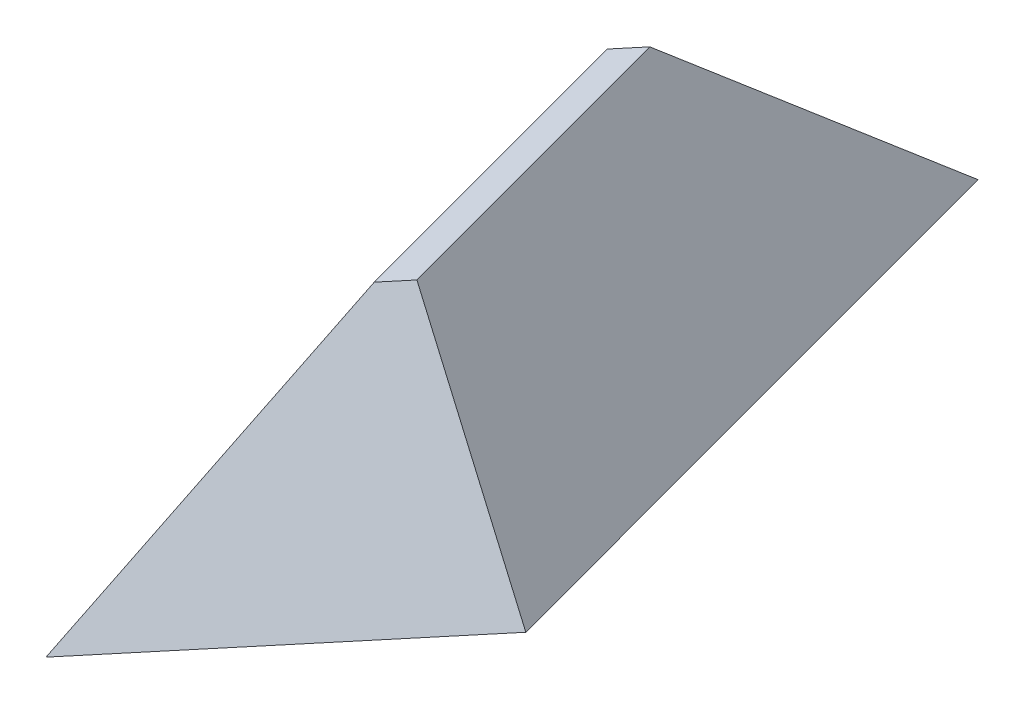
ISO-10303-21;
HEADER;
FILE_DESCRIPTION(('STEP AP214'),'2;1');
FILE_NAME('part.step','',(''),(''),'','','');
FILE_SCHEMA(('AUTOMOTIVE_DESIGN { 1 0 10303 214 1 1 1 1 }'));
ENDSEC;
DATA;
#1=APPLICATION_CONTEXT('core data for automotive mechanical design processes');
#2=APPLICATION_PROTOCOL_DEFINITION('international standard','automotive_design',2000,#1);
#3=PRODUCT_CONTEXT('',#1,'mechanical');
#4=PRODUCT('Part','Part','',(#3));
#5=PRODUCT_RELATED_PRODUCT_CATEGORY('part','',(#4));
#6=PRODUCT_DEFINITION_FORMATION('','',#4);
#7=PRODUCT_DEFINITION_CONTEXT('part definition',#1,'design');
#8=PRODUCT_DEFINITION('design','',#6,#7);
#9=PRODUCT_DEFINITION_SHAPE('','',#8);
#10=(LENGTH_UNIT() NAMED_UNIT(*) SI_UNIT(.MILLI.,.METRE.));
#11=(NAMED_UNIT(*) PLANE_ANGLE_UNIT() SI_UNIT($,.RADIAN.));
#12=(NAMED_UNIT(*) SI_UNIT($,.STERADIAN.) SOLID_ANGLE_UNIT());
#13=UNCERTAINTY_MEASURE_WITH_UNIT(LENGTH_MEASURE(1.E-05),#10,'distance_accuracy_value','');
#14=(GEOMETRIC_REPRESENTATION_CONTEXT(3) GLOBAL_UNCERTAINTY_ASSIGNED_CONTEXT((#13)) GLOBAL_UNIT_ASSIGNED_CONTEXT((#10,
#11,#12)) REPRESENTATION_CONTEXT('',''));
#15=CARTESIAN_POINT('',(0.,0.,0.));
#16=DIRECTION('',(0.,0.,1.));
#17=DIRECTION('',(1.,0.,0.));
#18=AXIS2_PLACEMENT_3D('',#15,#16,#17);
#19=CARTESIAN_POINT('',(-0.109027255683212,0.,9.09803012849915));
#20=DIRECTION('',(0.664717477698489,0.500000000000001,0.555113209032318));
#21=DIRECTION('',(0.640989521331052,0.,-0.767549629368543));
#22=AXIS2_PLACEMENT_3D('',#19,#20,#21);
#23=PLANE('',#22);
#24=DIRECTION('',(0.640989521331052,0.,-0.767549629368543));
#25=VECTOR('',#24,1.);
#26=CARTESIAN_POINT('',(-0.109027255683212,0.,9.09803012849915));
#27=LINE('',#26,#25);
#28=CARTESIAN_POINT('',(-0.109027255683212,0.,9.09803012849915));
#29=VERTEX_POINT('',#28);
#30=CARTESIAN_POINT('',(2.87004363926258,0.,5.53075689674642));
#31=VERTEX_POINT('',#30);
#32=EDGE_CURVE('E79',#29,#31,#27,.T.);
#33=ORIENTED_EDGE('',*,*,#32,.T.);
#34=DIRECTION('',(0.532562407172726,-0.838224629779067,0.117289183210292));
#35=VECTOR('',#34,1.);
#36=CARTESIAN_POINT('',(2.87004363926258,0.,5.53075689674642));
#37=LINE('',#36,#35);
#38=CARTESIAN_POINT('',(0.964006564285093,3.,5.11097974259191));
#39=VERTEX_POINT('',#38);
#40=EDGE_CURVE('E11',#39,#31,#37,.T.);
#41=ORIENTED_EDGE('',*,*,#40,.F.);
#42=DIRECTION('',(-0.640989521331052,0.,0.767549629368543));
#43=VECTOR('',#42,1.);
#44=CARTESIAN_POINT('',(-1.43846221108019,3.,7.98780371043451));
#45=LINE('',#44,#43);
#46=CARTESIAN_POINT('',(0.699238393047662,3.,5.42802503731042));
#47=VERTEX_POINT('',#46);
#48=EDGE_CURVE('E95',#47,#39,#45,.F.);
#49=ORIENTED_EDGE('',*,*,#48,.F.);
#50=DIRECTION('',(-0.16808898565643,-0.623887650998258,0.763223618497795));
#51=VECTOR('',#50,1.);
#52=CARTESIAN_POINT('',(-0.109027255683212,0.,9.09803012849915));
#53=LINE('',#52,#51);
#54=EDGE_CURVE('E90',#47,#29,#53,.T.);
#55=ORIENTED_EDGE('',*,*,#54,.T.);
#56=EDGE_LOOP('',(#33,#41,#49,#55));
#57=FACE_BOUND('',#56,.T.);
#58=ADVANCED_FACE('F33',(#57),#23,.T.);
#59=CARTESIAN_POINT('',(2.87004363926258,0.,5.53075689674642));
#60=DIRECTION('',(0.836418180855726,0.500000000000001,-0.224509747525573));
#61=DIRECTION('',(-0.513098457866133,0.858329757456536,0.));
#62=AXIS2_PLACEMENT_3D('',#59,#60,#61);
#63=PLANE('',#62);
#64=DIRECTION('',(-0.25924152633917,0.,-0.965812523744302));
#65=VECTOR('',#64,1.);
#66=CARTESIAN_POINT('',(2.87004363926258,0.,5.53075689674642));
#67=LINE('',#66,#65);
#68=CARTESIAN_POINT('',(0.606547458734304,0.,-2.90196987150085));
#69=VERTEX_POINT('',#68);
#70=EDGE_CURVE('E75',#31,#69,#67,.T.);
#71=ORIENTED_EDGE('',*,*,#70,.T.);
#72=DIRECTION('',(0.16808898565643,-0.623887650998258,-0.763223618497795));
#73=VECTOR('',#72,1.);
#74=CARTESIAN_POINT('',(0.0647334247297071,2.01102459886305,-0.441813032723125));
#75=LINE('',#74,#73);
#76=CARTESIAN_POINT('',(-0.20171818999657,3.,0.76803521968788));
#77=VERTEX_POINT('',#76);
#78=EDGE_CURVE('E42',#77,#69,#75,.T.);
#79=ORIENTED_EDGE('',*,*,#78,.F.);
#80=DIRECTION('',(0.25924152633917,0.,0.965812523744302));
#81=VECTOR('',#80,1.);
#82=CARTESIAN_POINT('',(1.19720727755112,3.,5.97977639179757));
#83=LINE('',#82,#81);
#84=EDGE_CURVE('E86',#39,#77,#83,.F.);
#85=ORIENTED_EDGE('',*,*,#84,.F.);
#86=ORIENTED_EDGE('',*,*,#40,.T.);
#87=EDGE_LOOP('',(#71,#79,#85,#86));
#88=FACE_BOUND('',#87,.T.);
#89=ADVANCED_FACE('F35',(#88),#63,.T.);
#90=CARTESIAN_POINT('',(-2.37252343621148,0.,0.665303360251873));
#91=DIRECTION('',(-0.664717477698489,0.500000000000001,-0.555113209032318));
#92=DIRECTION('',(-0.640989521331052,0.,0.767549629368543));
#93=AXIS2_PLACEMENT_3D('',#90,#91,#92);
#94=PLANE('',#93);
#95=DIRECTION('',(-0.640989521331052,0.,0.767549629368543));
#96=VECTOR('',#95,1.);
#97=CARTESIAN_POINT('',(-2.37252343621148,0.,0.665303360251873));
#98=LINE('',#97,#96);
#99=CARTESIAN_POINT('',(-2.37252343621148,0.,0.665303360251873));
#100=VERTEX_POINT('',#99);
#101=EDGE_CURVE('E80',#69,#100,#98,.T.);
#102=ORIENTED_EDGE('',*,*,#101,.T.);
#103=DIRECTION('',(-0.532562407172726,-0.838224629779067,-0.117289183210292));
#104=VECTOR('',#103,1.);
#105=CARTESIAN_POINT('',(-1.20380425787303,1.83950122536665,0.922696890067923));
#106=LINE('',#105,#104);
#107=CARTESIAN_POINT('',(-0.466486361234,3.,1.08508051440638));
#108=VERTEX_POINT('',#107);
#109=EDGE_CURVE('E98',#108,#100,#106,.T.);
#110=ORIENTED_EDGE('',*,*,#109,.F.);
#111=DIRECTION('',(0.640989521331053,0.,-0.767549629368543));
#112=VECTOR('',#111,1.);
#113=CARTESIAN_POINT('',(-1.0430884808145,3.,1.77552977831651));
#114=LINE('',#113,#112);
#115=EDGE_CURVE('E54',#77,#108,#114,.F.);
#116=ORIENTED_EDGE('',*,*,#115,.F.);
#117=ORIENTED_EDGE('',*,*,#78,.T.);
#118=EDGE_LOOP('',(#102,#110,#116,#117));
#119=FACE_BOUND('',#118,.T.);
#120=ADVANCED_FACE('F105',(#119),#94,.T.);
#121=CARTESIAN_POINT('',(-0.109027255683212,0.,9.09803012849915));
#122=DIRECTION('',(-0.836418180855726,0.500000000000001,0.224509747525574));
#123=DIRECTION('',(-0.513098457866133,-0.858329757456536,0.));
#124=AXIS2_PLACEMENT_3D('',#121,#122,#123);
#125=PLANE('',#124);
#126=DIRECTION('',(0.25924152633917,0.,0.965812523744302));
#127=VECTOR('',#126,1.);
#128=CARTESIAN_POINT('',(-0.109027255683212,0.,9.09803012849915));
#129=LINE('',#128,#127);
#130=EDGE_CURVE('E94',#100,#29,#129,.T.);
#131=ORIENTED_EDGE('',*,*,#130,.T.);
#132=ORIENTED_EDGE('',*,*,#54,.F.);
#133=DIRECTION('',(-0.25924152633917,0.,-0.965812523744302));
#134=VECTOR('',#133,1.);
#135=CARTESIAN_POINT('',(1.56380910602825,3.,8.649010633448));
#136=LINE('',#135,#134);
#137=EDGE_CURVE('E37',#108,#47,#136,.F.);
#138=ORIENTED_EDGE('',*,*,#137,.F.);
#139=ORIENTED_EDGE('',*,*,#109,.T.);
#140=EDGE_LOOP('',(#131,#132,#138,#139));
#141=FACE_BOUND('',#140,.T.);
#142=ADVANCED_FACE('F107',(#141),#125,.T.);
#143=CARTESIAN_POINT('',(0.,3.,0.));
#144=DIRECTION('',(0.,1.,0.));
#145=DIRECTION('',(0.,0.,1.));
#146=AXIS2_PLACEMENT_3D('',#143,#144,#145);
#147=PLANE('',#146);
#148=ORIENTED_EDGE('',*,*,#48,.T.);
#149=ORIENTED_EDGE('',*,*,#84,.T.);
#150=ORIENTED_EDGE('',*,*,#115,.T.);
#151=ORIENTED_EDGE('',*,*,#137,.T.);
#152=EDGE_LOOP('',(#148,#149,#150,#151));
#153=FACE_BOUND('',#152,.T.);
#154=ADVANCED_FACE('F103',(#153),#147,.T.);
#155=CARTESIAN_POINT('',(0.,0.,0.));
#156=DIRECTION('',(0.,1.,0.));
#157=DIRECTION('',(0.,0.,1.));
#158=AXIS2_PLACEMENT_3D('',#155,#156,#157);
#159=PLANE('',#158);
#160=ORIENTED_EDGE('',*,*,#32,.F.);
#161=ORIENTED_EDGE('',*,*,#130,.F.);
#162=ORIENTED_EDGE('',*,*,#101,.F.);
#163=ORIENTED_EDGE('',*,*,#70,.F.);
#164=EDGE_LOOP('',(#160,#161,#162,#163));
#165=FACE_BOUND('',#164,.T.);
#166=ADVANCED_FACE('F76',(#165),#159,.F.);
#167=CLOSED_SHELL('',(#58,#89,#120,#142,#154,#166));
#168=MANIFOLD_SOLID_BREP('B2',#167);
#169=ADVANCED_BREP_SHAPE_REPRESENTATION('',(#18,#168),#14);
#170=SHAPE_DEFINITION_REPRESENTATION(#9,#169);
ENDSEC;
END-ISO-10303-21;
